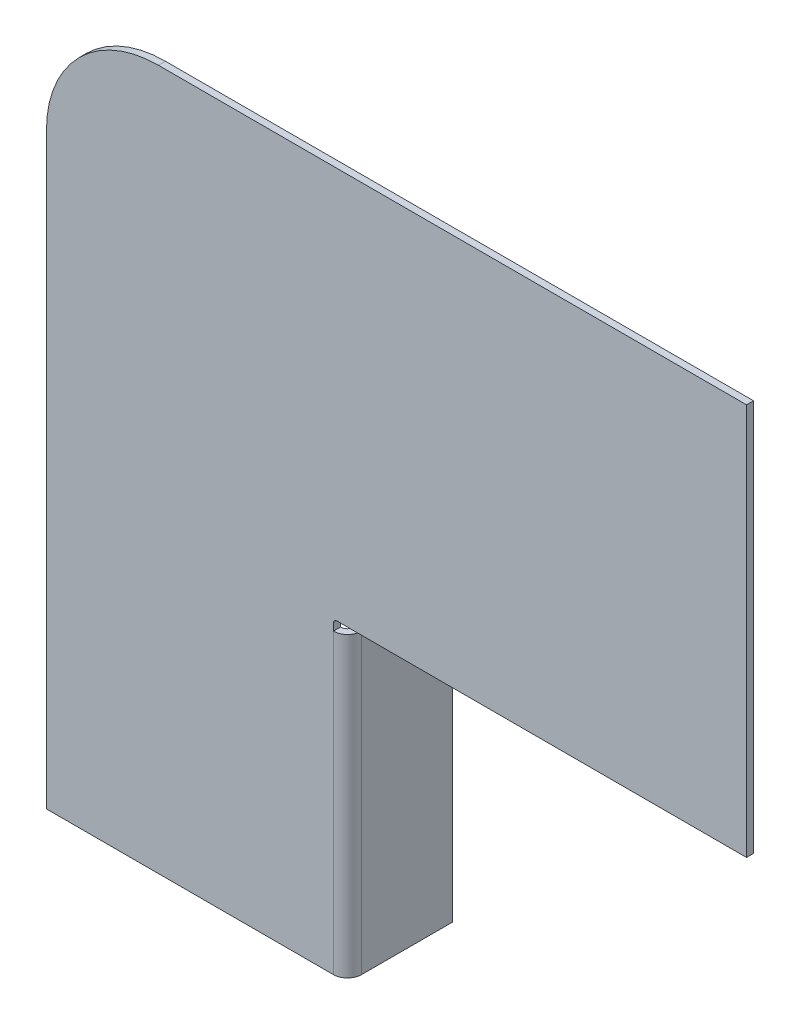
ISO-10303-21;
HEADER;
FILE_DESCRIPTION(('STEP AP214'),'2;1');
FILE_NAME('part.step','',(''),(''),'','','');
FILE_SCHEMA(('AUTOMOTIVE_DESIGN { 1 0 10303 214 1 1 1 1 }'));
ENDSEC;
DATA;
#1=APPLICATION_CONTEXT('core data for automotive mechanical design processes');
#2=APPLICATION_PROTOCOL_DEFINITION('international standard','automotive_design',2000,#1);
#3=PRODUCT_CONTEXT('',#1,'mechanical');
#4=PRODUCT('Part','Part','',(#3));
#5=PRODUCT_RELATED_PRODUCT_CATEGORY('part','',(#4));
#6=PRODUCT_DEFINITION_FORMATION('','',#4);
#7=PRODUCT_DEFINITION_CONTEXT('part definition',#1,'design');
#8=PRODUCT_DEFINITION('design','',#6,#7);
#9=PRODUCT_DEFINITION_SHAPE('','',#8);
#10=(LENGTH_UNIT() NAMED_UNIT(*) SI_UNIT(.MILLI.,.METRE.));
#11=(NAMED_UNIT(*) PLANE_ANGLE_UNIT() SI_UNIT($,.RADIAN.));
#12=(NAMED_UNIT(*) SI_UNIT($,.STERADIAN.) SOLID_ANGLE_UNIT());
#13=UNCERTAINTY_MEASURE_WITH_UNIT(LENGTH_MEASURE(1.E-05),#10,'distance_accuracy_value','');
#14=(GEOMETRIC_REPRESENTATION_CONTEXT(3) GLOBAL_UNCERTAINTY_ASSIGNED_CONTEXT((#13)) GLOBAL_UNIT_ASSIGNED_CONTEXT((#10,
#11,#12)) REPRESENTATION_CONTEXT('',''));
#15=CARTESIAN_POINT('',(0.,0.,0.));
#16=DIRECTION('',(0.,0.,1.));
#17=DIRECTION('',(1.,0.,0.));
#18=AXIS2_PLACEMENT_3D('',#15,#16,#17);
#19=CARTESIAN_POINT('',(0.,0.,-1.));
#20=DIRECTION('',(0.,0.,1.));
#21=DIRECTION('',(1.,0.,0.));
#22=AXIS2_PLACEMENT_3D('',#19,#20,#21);
#23=CYLINDRICAL_SURFACE('',#22,16.);
#24=CARTESIAN_POINT('',(0.,0.,0.));
#25=DIRECTION('',(0.,0.,1.));
#26=DIRECTION('',(1.,0.,0.));
#27=AXIS2_PLACEMENT_3D('',#24,#25,#26);
#28=CIRCLE('',#27,16.);
#29=CARTESIAN_POINT('',(0.,16.,0.));
#30=VERTEX_POINT('',#29);
#31=CARTESIAN_POINT('',(-16.,0.,0.));
#32=VERTEX_POINT('',#31);
#33=EDGE_CURVE('E166',#30,#32,#28,.T.);
#34=ORIENTED_EDGE('',*,*,#33,.F.);
#35=DIRECTION('',(0.,0.,1.));
#36=VECTOR('',#35,1.);
#37=CARTESIAN_POINT('',(0.,16.,-1.));
#38=LINE('',#37,#36);
#39=CARTESIAN_POINT('',(0.,16.,-1.));
#40=VERTEX_POINT('',#39);
#41=EDGE_CURVE('E13',#40,#30,#38,.T.);
#42=ORIENTED_EDGE('',*,*,#41,.F.);
#43=CARTESIAN_POINT('',(0.,0.,-1.));
#44=DIRECTION('',(0.,0.,1.));
#45=DIRECTION('',(1.,0.,0.));
#46=AXIS2_PLACEMENT_3D('',#43,#44,#45);
#47=CIRCLE('',#46,16.);
#48=CARTESIAN_POINT('',(-16.,0.,-1.));
#49=VERTEX_POINT('',#48);
#50=EDGE_CURVE('E187',#40,#49,#47,.T.);
#51=ORIENTED_EDGE('',*,*,#50,.T.);
#52=DIRECTION('',(0.,0.,1.));
#53=VECTOR('',#52,1.);
#54=CARTESIAN_POINT('',(-16.,0.,-1.));
#55=LINE('',#54,#53);
#56=EDGE_CURVE('E60',#49,#32,#55,.T.);
#57=ORIENTED_EDGE('',*,*,#56,.T.);
#58=EDGE_LOOP('',(#34,#42,#51,#57));
#59=FACE_BOUND('',#58,.T.);
#60=ADVANCED_FACE('F57',(#59),#23,.T.);
#61=CARTESIAN_POINT('',(0.,16.,-1.));
#62=DIRECTION('',(0.,1.,0.));
#63=DIRECTION('',(0.,0.,1.));
#64=AXIS2_PLACEMENT_3D('',#61,#62,#63);
#65=PLANE('',#64);
#66=DIRECTION('',(-1.,0.,0.));
#67=VECTOR('',#66,1.);
#68=CARTESIAN_POINT('',(0.,16.,0.));
#69=LINE('',#68,#67);
#70=CARTESIAN_POINT('',(84.,16.,0.));
#71=VERTEX_POINT('',#70);
#72=EDGE_CURVE('E185',#71,#30,#69,.T.);
#73=ORIENTED_EDGE('',*,*,#72,.F.);
#74=DIRECTION('',(0.,0.,1.));
#75=VECTOR('',#74,1.);
#76=CARTESIAN_POINT('',(84.,16.,-1.));
#77=LINE('',#76,#75);
#78=CARTESIAN_POINT('',(84.,16.,-1.));
#79=VERTEX_POINT('',#78);
#80=EDGE_CURVE('E65',#79,#71,#77,.T.);
#81=ORIENTED_EDGE('',*,*,#80,.F.);
#82=DIRECTION('',(-1.,0.,0.));
#83=VECTOR('',#82,1.);
#84=CARTESIAN_POINT('',(0.,16.,-1.));
#85=LINE('',#84,#83);
#86=EDGE_CURVE('E156',#79,#40,#85,.T.);
#87=ORIENTED_EDGE('',*,*,#86,.T.);
#88=ORIENTED_EDGE('',*,*,#41,.T.);
#89=EDGE_LOOP('',(#73,#81,#87,#88));
#90=FACE_BOUND('',#89,.T.);
#91=ADVANCED_FACE('F200',(#90),#65,.T.);
#92=CARTESIAN_POINT('',(84.,16.,-1.));
#93=DIRECTION('',(1.,0.,0.));
#94=DIRECTION('',(0.,0.,-1.));
#95=AXIS2_PLACEMENT_3D('',#92,#93,#94);
#96=PLANE('',#95);
#97=DIRECTION('',(0.,1.,0.));
#98=VECTOR('',#97,1.);
#99=CARTESIAN_POINT('',(84.,16.,0.));
#100=LINE('',#99,#98);
#101=CARTESIAN_POINT('',(84.,-40.,0.));
#102=VERTEX_POINT('',#101);
#103=EDGE_CURVE('E143',#102,#71,#100,.T.);
#104=ORIENTED_EDGE('',*,*,#103,.F.);
#105=DIRECTION('',(0.,0.,1.));
#106=VECTOR('',#105,1.);
#107=CARTESIAN_POINT('',(84.,-40.,-1.));
#108=LINE('',#107,#106);
#109=CARTESIAN_POINT('',(84.,-40.,-1.));
#110=VERTEX_POINT('',#109);
#111=EDGE_CURVE('E137',#110,#102,#108,.T.);
#112=ORIENTED_EDGE('',*,*,#111,.F.);
#113=DIRECTION('',(0.,1.,0.));
#114=VECTOR('',#113,1.);
#115=CARTESIAN_POINT('',(84.,16.,-1.));
#116=LINE('',#115,#114);
#117=EDGE_CURVE('E140',#110,#79,#116,.T.);
#118=ORIENTED_EDGE('',*,*,#117,.T.);
#119=ORIENTED_EDGE('',*,*,#80,.T.);
#120=EDGE_LOOP('',(#104,#112,#118,#119));
#121=FACE_BOUND('',#120,.T.);
#122=ADVANCED_FACE('F139',(#121),#96,.T.);
#123=CARTESIAN_POINT('',(84.,-40.,-1.));
#124=DIRECTION('',(0.,-1.,0.));
#125=DIRECTION('',(0.,0.,-1.));
#126=AXIS2_PLACEMENT_3D('',#123,#124,#125);
#127=PLANE('',#126);
#128=DIRECTION('',(1.,0.,0.));
#129=VECTOR('',#128,1.);
#130=CARTESIAN_POINT('',(84.,-40.,0.));
#131=LINE('',#130,#129);
#132=CARTESIAN_POINT('',(25.5,-40.,0.));
#133=VERTEX_POINT('',#132);
#134=EDGE_CURVE('E182',#133,#102,#131,.T.);
#135=ORIENTED_EDGE('',*,*,#134,.F.);
#136=DIRECTION('',(0.,0.,1.));
#137=VECTOR('',#136,1.);
#138=CARTESIAN_POINT('',(25.5,-40.,-1.));
#139=LINE('',#138,#137);
#140=CARTESIAN_POINT('',(25.5,-40.,-1.));
#141=VERTEX_POINT('',#140);
#142=EDGE_CURVE('E148',#141,#133,#139,.T.);
#143=ORIENTED_EDGE('',*,*,#142,.F.);
#144=DIRECTION('',(1.,0.,0.));
#145=VECTOR('',#144,1.);
#146=CARTESIAN_POINT('',(84.,-40.,-1.));
#147=LINE('',#146,#145);
#148=EDGE_CURVE('E154',#141,#110,#147,.T.);
#149=ORIENTED_EDGE('',*,*,#148,.T.);
#150=ORIENTED_EDGE('',*,*,#111,.T.);
#151=EDGE_LOOP('',(#135,#143,#149,#150));
#152=FACE_BOUND('',#151,.T.);
#153=ADVANCED_FACE('F158',(#152),#127,.T.);
#154=CARTESIAN_POINT('',(25.5,-40.5,-1.));
#155=DIRECTION('',(0.,0.,1.));
#156=DIRECTION('',(1.,0.,0.));
#157=AXIS2_PLACEMENT_3D('',#154,#155,#156);
#158=CYLINDRICAL_SURFACE('',#157,0.5);
#159=CARTESIAN_POINT('',(25.5,-40.5,0.));
#160=DIRECTION('',(0.,0.,-1.));
#161=DIRECTION('',(1.,0.,0.));
#162=AXIS2_PLACEMENT_3D('',#159,#160,#161);
#163=CIRCLE('',#162,0.5);
#164=CARTESIAN_POINT('',(25.,-40.5,0.));
#165=VERTEX_POINT('',#164);
#166=EDGE_CURVE('E179',#165,#133,#163,.T.);
#167=ORIENTED_EDGE('',*,*,#166,.F.);
#168=DIRECTION('',(0.,0.,1.));
#169=VECTOR('',#168,1.);
#170=CARTESIAN_POINT('',(25.,-40.5,-1.));
#171=LINE('',#170,#169);
#172=CARTESIAN_POINT('',(25.,-40.5,-1.));
#173=VERTEX_POINT('',#172);
#174=EDGE_CURVE('E191',#173,#165,#171,.T.);
#175=ORIENTED_EDGE('',*,*,#174,.F.);
#176=CARTESIAN_POINT('',(25.5,-40.5,-1.));
#177=DIRECTION('',(0.,0.,-1.));
#178=DIRECTION('',(1.,0.,0.));
#179=AXIS2_PLACEMENT_3D('',#176,#177,#178);
#180=CIRCLE('',#179,0.5);
#181=EDGE_CURVE('E159',#173,#141,#180,.T.);
#182=ORIENTED_EDGE('',*,*,#181,.T.);
#183=ORIENTED_EDGE('',*,*,#142,.T.);
#184=EDGE_LOOP('',(#167,#175,#182,#183));
#185=FACE_BOUND('',#184,.T.);
#186=ADVANCED_FACE('F213',(#185),#158,.F.);
#187=CARTESIAN_POINT('',(25.,-84.,-1.));
#188=DIRECTION('',(1.,0.,0.));
#189=DIRECTION('',(0.,0.,-1.));
#190=AXIS2_PLACEMENT_3D('',#187,#188,#189);
#191=PLANE('',#190);
#192=DIRECTION('',(0.,0.,1.));
#193=VECTOR('',#192,1.);
#194=CARTESIAN_POINT('',(25.,-41.5,-0.999999999999997));
#195=LINE('',#194,#193);
#196=CARTESIAN_POINT('',(25.,-41.5,-1.));
#197=VERTEX_POINT('',#196);
#198=CARTESIAN_POINT('',(25.,-41.5,0.));
#199=VERTEX_POINT('',#198);
#200=EDGE_CURVE('E73',#197,#199,#195,.T.);
#201=ORIENTED_EDGE('',*,*,#200,.F.);
#202=DIRECTION('',(0.,1.,0.));
#203=VECTOR('',#202,1.);
#204=CARTESIAN_POINT('',(25.,-84.,-1.));
#205=LINE('',#204,#203);
#206=EDGE_CURVE('E333',#197,#173,#205,.T.);
#207=ORIENTED_EDGE('',*,*,#206,.T.);
#208=ORIENTED_EDGE('',*,*,#174,.T.);
#209=DIRECTION('',(0.,1.,0.));
#210=VECTOR('',#209,1.);
#211=CARTESIAN_POINT('',(25.,-84.,0.));
#212=LINE('',#211,#210);
#213=EDGE_CURVE('E175',#199,#165,#212,.T.);
#214=ORIENTED_EDGE('',*,*,#213,.F.);
#215=EDGE_LOOP('',(#201,#207,#208,#214));
#216=FACE_BOUND('',#215,.T.);
#217=ADVANCED_FACE('F216',(#216),#191,.T.);
#218=CARTESIAN_POINT('',(-16.,-84.,-1.));
#219=DIRECTION('',(0.,-1.,0.));
#220=DIRECTION('',(0.,0.,-1.));
#221=AXIS2_PLACEMENT_3D('',#218,#219,#220);
#222=PLANE('',#221);
#223=DIRECTION('',(1.,0.,0.));
#224=VECTOR('',#223,1.);
#225=CARTESIAN_POINT('',(-16.,-84.,0.));
#226=LINE('',#225,#224);
#227=CARTESIAN_POINT('',(-16.,-84.,0.));
#228=VERTEX_POINT('',#227);
#229=CARTESIAN_POINT('',(25.,-84.,0.));
#230=VERTEX_POINT('',#229);
#231=EDGE_CURVE('E172',#228,#230,#226,.T.);
#232=ORIENTED_EDGE('',*,*,#231,.F.);
#233=DIRECTION('',(0.,0.,1.));
#234=VECTOR('',#233,1.);
#235=CARTESIAN_POINT('',(-16.,-84.,-1.));
#236=LINE('',#235,#234);
#237=CARTESIAN_POINT('',(-16.,-84.,-1.));
#238=VERTEX_POINT('',#237);
#239=EDGE_CURVE('E195',#238,#228,#236,.T.);
#240=ORIENTED_EDGE('',*,*,#239,.F.);
#241=DIRECTION('',(1.,0.,0.));
#242=VECTOR('',#241,1.);
#243=CARTESIAN_POINT('',(-16.,-84.,-1.));
#244=LINE('',#243,#242);
#245=CARTESIAN_POINT('',(25.,-84.,-1.));
#246=VERTEX_POINT('',#245);
#247=EDGE_CURVE('E331',#238,#246,#244,.T.);
#248=ORIENTED_EDGE('',*,*,#247,.T.);
#249=DIRECTION('',(0.,0.,1.));
#250=VECTOR('',#249,1.);
#251=CARTESIAN_POINT('',(25.,-84.,-1.));
#252=LINE('',#251,#250);
#253=EDGE_CURVE('E194',#246,#230,#252,.T.);
#254=ORIENTED_EDGE('',*,*,#253,.T.);
#255=EDGE_LOOP('',(#232,#240,#248,#254));
#256=FACE_BOUND('',#255,.T.);
#257=ADVANCED_FACE('F220',(#256),#222,.T.);
#258=CARTESIAN_POINT('',(-16.,0.,-1.));
#259=DIRECTION('',(-1.,0.,0.));
#260=DIRECTION('',(0.,-1.,0.));
#261=AXIS2_PLACEMENT_3D('',#258,#259,#260);
#262=PLANE('',#261);
#263=DIRECTION('',(0.,-1.,0.));
#264=VECTOR('',#263,1.);
#265=CARTESIAN_POINT('',(-16.,0.,0.));
#266=LINE('',#265,#264);
#267=EDGE_CURVE('E169',#32,#228,#266,.T.);
#268=ORIENTED_EDGE('',*,*,#267,.F.);
#269=ORIENTED_EDGE('',*,*,#56,.F.);
#270=DIRECTION('',(0.,-1.,0.));
#271=VECTOR('',#270,1.);
#272=CARTESIAN_POINT('',(-16.,0.,-1.));
#273=LINE('',#272,#271);
#274=EDGE_CURVE('E329',#49,#238,#273,.T.);
#275=ORIENTED_EDGE('',*,*,#274,.T.);
#276=ORIENTED_EDGE('',*,*,#239,.T.);
#277=EDGE_LOOP('',(#268,#269,#275,#276));
#278=FACE_BOUND('',#277,.T.);
#279=ADVANCED_FACE('F197',(#278),#262,.T.);
#280=CARTESIAN_POINT('',(0.,0.,-1.));
#281=DIRECTION('',(0.,0.,1.));
#282=DIRECTION('',(1.,0.,0.));
#283=AXIS2_PLACEMENT_3D('',#280,#281,#282);
#284=PLANE('',#283);
#285=ORIENTED_EDGE('',*,*,#50,.F.);
#286=ORIENTED_EDGE('',*,*,#86,.F.);
#287=ORIENTED_EDGE('',*,*,#117,.F.);
#288=ORIENTED_EDGE('',*,*,#148,.F.);
#289=ORIENTED_EDGE('',*,*,#181,.F.);
#290=ORIENTED_EDGE('',*,*,#206,.F.);
#291=EDGE_CURVE('E161',#246,#197,#205,.T.);
#292=ORIENTED_EDGE('',*,*,#291,.F.);
#293=ORIENTED_EDGE('',*,*,#247,.F.);
#294=ORIENTED_EDGE('',*,*,#274,.F.);
#295=EDGE_LOOP('',(#285,#286,#287,#288,#289,#290,#292,#293,#294));
#296=FACE_BOUND('',#295,.T.);
#297=ADVANCED_FACE('F152',(#296),#284,.F.);
#298=CARTESIAN_POINT('',(0.,0.,0.));
#299=DIRECTION('',(0.,0.,1.));
#300=DIRECTION('',(1.,0.,0.));
#301=AXIS2_PLACEMENT_3D('',#298,#299,#300);
#302=PLANE('',#301);
#303=ORIENTED_EDGE('',*,*,#33,.T.);
#304=ORIENTED_EDGE('',*,*,#267,.T.);
#305=ORIENTED_EDGE('',*,*,#231,.T.);
#306=EDGE_CURVE('E176',#230,#199,#212,.T.);
#307=ORIENTED_EDGE('',*,*,#306,.T.);
#308=ORIENTED_EDGE('',*,*,#213,.T.);
#309=ORIENTED_EDGE('',*,*,#166,.T.);
#310=ORIENTED_EDGE('',*,*,#134,.T.);
#311=ORIENTED_EDGE('',*,*,#103,.T.);
#312=ORIENTED_EDGE('',*,*,#72,.T.);
#313=EDGE_LOOP('',(#303,#304,#305,#307,#308,#309,#310,#311,#312));
#314=FACE_BOUND('',#313,.T.);
#315=ADVANCED_FACE('F199',(#314),#302,.T.);
#316=CARTESIAN_POINT('',(25.,-41.5,-2.));
#317=DIRECTION('',(0.,1.,0.));
#318=DIRECTION('',(0.,0.,1.));
#319=AXIS2_PLACEMENT_3D('',#316,#317,#318);
#320=PLANE('',#319);
#321=DIRECTION('',(-1.,0.,0.));
#322=VECTOR('',#321,1.);
#323=CARTESIAN_POINT('',(27.,-41.5,-1.99999999999999));
#324=LINE('',#323,#322);
#325=CARTESIAN_POINT('',(26.,-41.5,-1.99999999999999));
#326=VERTEX_POINT('',#325);
#327=CARTESIAN_POINT('',(27.,-41.5,-1.99999999999999));
#328=VERTEX_POINT('',#327);
#329=EDGE_CURVE('E313',#326,#328,#324,.F.);
#330=ORIENTED_EDGE('',*,*,#329,.F.);
#331=CARTESIAN_POINT('',(25.,-41.5,-2.));
#332=DIRECTION('',(0.,-1.,0.));
#333=DIRECTION('',(0.,0.,-1.));
#334=AXIS2_PLACEMENT_3D('',#331,#332,#333);
#335=CIRCLE('',#334,1.);
#336=EDGE_CURVE('E321',#197,#326,#335,.F.);
#337=ORIENTED_EDGE('',*,*,#336,.F.);
#338=ORIENTED_EDGE('',*,*,#200,.T.);
#339=CARTESIAN_POINT('',(25.,-41.5,-2.));
#340=DIRECTION('',(0.,-1.,0.));
#341=DIRECTION('',(0.,0.,-1.));
#342=AXIS2_PLACEMENT_3D('',#339,#340,#341);
#343=CIRCLE('',#342,2.);
#344=EDGE_CURVE('E316',#199,#328,#343,.F.);
#345=ORIENTED_EDGE('',*,*,#344,.T.);
#346=EDGE_LOOP('',(#330,#337,#338,#345));
#347=FACE_BOUND('',#346,.T.);
#348=ADVANCED_FACE('F230',(#347),#320,.T.);
#349=CARTESIAN_POINT('',(25.,-84.,-2.));
#350=DIRECTION('',(0.,1.,0.));
#351=DIRECTION('',(0.,0.,1.));
#352=AXIS2_PLACEMENT_3D('',#349,#350,#351);
#353=PLANE('',#352);
#354=CARTESIAN_POINT('',(25.,-84.,-2.));
#355=DIRECTION('',(0.,-1.,0.));
#356=DIRECTION('',(0.,0.,-1.));
#357=AXIS2_PLACEMENT_3D('',#354,#355,#356);
#358=CIRCLE('',#357,1.);
#359=CARTESIAN_POINT('',(26.,-84.,-1.99999999999999));
#360=VERTEX_POINT('',#359);
#361=EDGE_CURVE('E324',#360,#246,#358,.T.);
#362=ORIENTED_EDGE('',*,*,#361,.F.);
#363=DIRECTION('',(-1.,0.,0.));
#364=VECTOR('',#363,1.);
#365=CARTESIAN_POINT('',(26.,-84.,-1.99999999999999));
#366=LINE('',#365,#364);
#367=CARTESIAN_POINT('',(27.,-84.,-1.99999999999999));
#368=VERTEX_POINT('',#367);
#369=EDGE_CURVE('E288',#360,#368,#366,.F.);
#370=ORIENTED_EDGE('',*,*,#369,.T.);
#371=CARTESIAN_POINT('',(25.,-84.,-2.));
#372=DIRECTION('',(0.,-1.,0.));
#373=DIRECTION('',(0.,0.,-1.));
#374=AXIS2_PLACEMENT_3D('',#371,#372,#373);
#375=CIRCLE('',#374,2.);
#376=EDGE_CURVE('E318',#368,#230,#375,.T.);
#377=ORIENTED_EDGE('',*,*,#376,.T.);
#378=ORIENTED_EDGE('',*,*,#253,.F.);
#379=EDGE_LOOP('',(#362,#370,#377,#378));
#380=FACE_BOUND('',#379,.T.);
#381=ADVANCED_FACE('F232',(#380),#353,.F.);
#382=CARTESIAN_POINT('',(25.,-84.,-2.));
#383=DIRECTION('',(0.,-1.,0.));
#384=DIRECTION('',(1.,0.,0.));
#385=AXIS2_PLACEMENT_3D('',#382,#383,#384);
#386=CYLINDRICAL_SURFACE('',#385,2.);
#387=ORIENTED_EDGE('',*,*,#306,.F.);
#388=ORIENTED_EDGE('',*,*,#376,.F.);
#389=DIRECTION('',(0.,-1.,0.));
#390=VECTOR('',#389,1.);
#391=CARTESIAN_POINT('',(27.,-41.5,-1.99999999999999));
#392=LINE('',#391,#390);
#393=EDGE_CURVE('E273',#368,#328,#392,.F.);
#394=ORIENTED_EDGE('',*,*,#393,.T.);
#395=ORIENTED_EDGE('',*,*,#344,.F.);
#396=EDGE_LOOP('',(#387,#388,#394,#395));
#397=FACE_BOUND('',#396,.T.);
#398=ADVANCED_FACE('F235',(#397),#386,.T.);
#399=CARTESIAN_POINT('',(25.,-84.,-2.));
#400=DIRECTION('',(0.,-1.,0.));
#401=DIRECTION('',(1.,0.,0.));
#402=AXIS2_PLACEMENT_3D('',#399,#400,#401);
#403=CYLINDRICAL_SURFACE('',#402,1.);
#404=ORIENTED_EDGE('',*,*,#291,.T.);
#405=ORIENTED_EDGE('',*,*,#336,.T.);
#406=DIRECTION('',(0.,-1.,0.));
#407=VECTOR('',#406,1.);
#408=CARTESIAN_POINT('',(26.,-41.5,-1.99999999999999));
#409=LINE('',#408,#407);
#410=EDGE_CURVE('E310',#326,#360,#409,.T.);
#411=ORIENTED_EDGE('',*,*,#410,.T.);
#412=ORIENTED_EDGE('',*,*,#361,.T.);
#413=EDGE_LOOP('',(#404,#405,#411,#412));
#414=FACE_BOUND('',#413,.T.);
#415=ADVANCED_FACE('F240',(#414),#403,.F.);
#416=CARTESIAN_POINT('',(27.0000000000001,-84.,-15.));
#417=DIRECTION('',(0.,1.,0.));
#418=DIRECTION('',(0.,0.,1.));
#419=AXIS2_PLACEMENT_3D('',#416,#417,#418);
#420=PLANE('',#419);
#421=ORIENTED_EDGE('',*,*,#369,.F.);
#422=DIRECTION('',(0.,0.,1.));
#423=VECTOR('',#422,1.);
#424=CARTESIAN_POINT('',(26.0000000000001,-84.,-15.));
#425=LINE('',#424,#423);
#426=CARTESIAN_POINT('',(26.0000000000001,-84.,-15.));
#427=VERTEX_POINT('',#426);
#428=EDGE_CURVE('E287',#360,#427,#425,.F.);
#429=ORIENTED_EDGE('',*,*,#428,.T.);
#430=DIRECTION('',(-1.,0.,0.));
#431=VECTOR('',#430,1.);
#432=CARTESIAN_POINT('',(27.0000000000001,-84.,-15.));
#433=LINE('',#432,#431);
#434=CARTESIAN_POINT('',(27.0000000000001,-84.,-15.));
#435=VERTEX_POINT('',#434);
#436=EDGE_CURVE('E296',#435,#427,#433,.T.);
#437=ORIENTED_EDGE('',*,*,#436,.F.);
#438=DIRECTION('',(0.,0.,-1.));
#439=VECTOR('',#438,1.);
#440=CARTESIAN_POINT('',(27.,-84.,0.));
#441=LINE('',#440,#439);
#442=EDGE_CURVE('E277',#368,#435,#441,.T.);
#443=ORIENTED_EDGE('',*,*,#442,.F.);
#444=EDGE_LOOP('',(#421,#429,#437,#443));
#445=FACE_BOUND('',#444,.T.);
#446=ADVANCED_FACE('F243',(#445),#420,.F.);
#447=CARTESIAN_POINT('',(27.,-41.5,-0.999999999999994));
#448=DIRECTION('',(0.,-1.,0.));
#449=DIRECTION('',(0.,0.,-1.));
#450=AXIS2_PLACEMENT_3D('',#447,#448,#449);
#451=PLANE('',#450);
#452=ORIENTED_EDGE('',*,*,#329,.T.);
#453=DIRECTION('',(0.,0.,1.));
#454=VECTOR('',#453,1.);
#455=CARTESIAN_POINT('',(27.,-41.5,0.));
#456=LINE('',#455,#454);
#457=CARTESIAN_POINT('',(27.0000000000001,-41.5,-15.));
#458=VERTEX_POINT('',#457);
#459=EDGE_CURVE('E281',#458,#328,#456,.T.);
#460=ORIENTED_EDGE('',*,*,#459,.F.);
#461=DIRECTION('',(-1.,0.,0.));
#462=VECTOR('',#461,1.);
#463=CARTESIAN_POINT('',(27.0000000000001,-41.5,-15.));
#464=LINE('',#463,#462);
#465=CARTESIAN_POINT('',(26.0000000000001,-41.5,-15.));
#466=VERTEX_POINT('',#465);
#467=EDGE_CURVE('E351',#458,#466,#464,.T.);
#468=ORIENTED_EDGE('',*,*,#467,.T.);
#469=DIRECTION('',(0.,0.,-1.));
#470=VECTOR('',#469,1.);
#471=CARTESIAN_POINT('',(26.,-41.5,-0.999999999999997));
#472=LINE('',#471,#470);
#473=EDGE_CURVE('E298',#466,#326,#472,.F.);
#474=ORIENTED_EDGE('',*,*,#473,.T.);
#475=EDGE_LOOP('',(#452,#460,#468,#474));
#476=FACE_BOUND('',#475,.T.);
#477=ADVANCED_FACE('F250',(#476),#451,.F.);
#478=CARTESIAN_POINT('',(27.,0.,0.));
#479=DIRECTION('',(-1.,0.,0.));
#480=DIRECTION('',(0.,0.,1.));
#481=AXIS2_PLACEMENT_3D('',#478,#479,#480);
#482=PLANE('',#481);
#483=ORIENTED_EDGE('',*,*,#393,.F.);
#484=ORIENTED_EDGE('',*,*,#442,.T.);
#485=DIRECTION('',(0.,1.,0.));
#486=VECTOR('',#485,1.);
#487=CARTESIAN_POINT('',(27.0000000000001,0.,-15.));
#488=LINE('',#487,#486);
#489=EDGE_CURVE('E297',#435,#458,#488,.T.);
#490=ORIENTED_EDGE('',*,*,#489,.T.);
#491=ORIENTED_EDGE('',*,*,#459,.T.);
#492=EDGE_LOOP('',(#483,#484,#490,#491));
#493=FACE_BOUND('',#492,.T.);
#494=ADVANCED_FACE('F259',(#493),#482,.F.);
#495=CARTESIAN_POINT('',(26.,0.,0.));
#496=DIRECTION('',(-1.,0.,0.));
#497=DIRECTION('',(0.,0.,1.));
#498=AXIS2_PLACEMENT_3D('',#495,#496,#497);
#499=PLANE('',#498);
#500=ORIENTED_EDGE('',*,*,#428,.F.);
#501=ORIENTED_EDGE('',*,*,#410,.F.);
#502=ORIENTED_EDGE('',*,*,#473,.F.);
#503=DIRECTION('',(0.,-1.,0.));
#504=VECTOR('',#503,1.);
#505=CARTESIAN_POINT('',(26.0000000000001,-41.5,-15.));
#506=LINE('',#505,#504);
#507=EDGE_CURVE('E302',#427,#466,#506,.F.);
#508=ORIENTED_EDGE('',*,*,#507,.F.);
#509=EDGE_LOOP('',(#500,#501,#502,#508));
#510=FACE_BOUND('',#509,.T.);
#511=ADVANCED_FACE('F255',(#510),#499,.T.);
#512=CARTESIAN_POINT('',(27.0000000000001,-41.5,-15.));
#513=DIRECTION('',(0.,0.,1.));
#514=DIRECTION('',(1.,0.,0.));
#515=AXIS2_PLACEMENT_3D('',#512,#513,#514);
#516=PLANE('',#515);
#517=ORIENTED_EDGE('',*,*,#507,.T.);
#518=ORIENTED_EDGE('',*,*,#467,.F.);
#519=ORIENTED_EDGE('',*,*,#489,.F.);
#520=ORIENTED_EDGE('',*,*,#436,.T.);
#521=EDGE_LOOP('',(#517,#518,#519,#520));
#522=FACE_BOUND('',#521,.T.);
#523=ADVANCED_FACE('F252',(#522),#516,.F.);
#524=CLOSED_SHELL('',(#60,#91,#122,#153,#186,#217,#257,#279,#297,#315,#348,#381,#398,#415,#446,
#477,#494,#511,#523));
#525=MANIFOLD_SOLID_BREP('B2',#524);
#526=ADVANCED_BREP_SHAPE_REPRESENTATION('',(#18,#525),#14);
#527=SHAPE_DEFINITION_REPRESENTATION(#9,#526);
ENDSEC;
END-ISO-10303-21;
